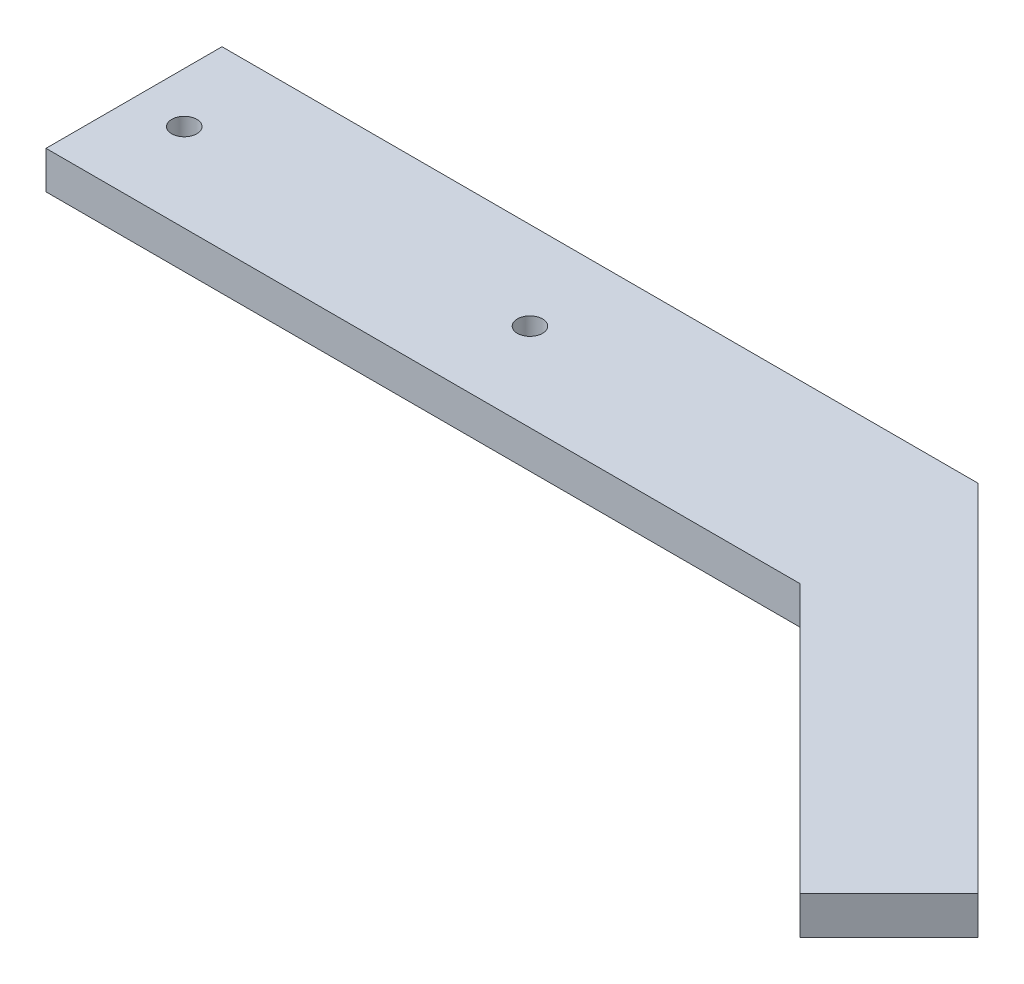
ISO-10303-21;
HEADER;
FILE_DESCRIPTION(('STEP AP214'),'2;1');
FILE_NAME('part.step','',(''),(''),'','','');
FILE_SCHEMA(('AUTOMOTIVE_DESIGN { 1 0 10303 214 1 1 1 1 }'));
ENDSEC;
DATA;
#1=APPLICATION_CONTEXT('core data for automotive mechanical design processes');
#2=APPLICATION_PROTOCOL_DEFINITION('international standard','automotive_design',2000,#1);
#3=PRODUCT_CONTEXT('',#1,'mechanical');
#4=PRODUCT('Part','Part','',(#3));
#5=PRODUCT_RELATED_PRODUCT_CATEGORY('part','',(#4));
#6=PRODUCT_DEFINITION_FORMATION('','',#4);
#7=PRODUCT_DEFINITION_CONTEXT('part definition',#1,'design');
#8=PRODUCT_DEFINITION('design','',#6,#7);
#9=PRODUCT_DEFINITION_SHAPE('','',#8);
#10=(LENGTH_UNIT() NAMED_UNIT(*) SI_UNIT(.MILLI.,.METRE.));
#11=(NAMED_UNIT(*) PLANE_ANGLE_UNIT() SI_UNIT($,.RADIAN.));
#12=(NAMED_UNIT(*) SI_UNIT($,.STERADIAN.) SOLID_ANGLE_UNIT());
#13=UNCERTAINTY_MEASURE_WITH_UNIT(LENGTH_MEASURE(1.E-05),#10,'distance_accuracy_value','');
#14=(GEOMETRIC_REPRESENTATION_CONTEXT(3) GLOBAL_UNCERTAINTY_ASSIGNED_CONTEXT((#13)) GLOBAL_UNIT_ASSIGNED_CONTEXT((#10,
#11,#12)) REPRESENTATION_CONTEXT('',''));
#15=CARTESIAN_POINT('',(0.,0.,0.));
#16=DIRECTION('',(0.,0.,1.));
#17=DIRECTION('',(1.,0.,0.));
#18=AXIS2_PLACEMENT_3D('',#15,#16,#17);
#19=CARTESIAN_POINT('',(0.,3.,0.));
#20=DIRECTION('',(1.,0.,0.));
#21=DIRECTION('',(0.,0.,-1.));
#22=AXIS2_PLACEMENT_3D('',#19,#20,#21);
#23=PLANE('',#22);
#24=DIRECTION('',(0.,0.,1.));
#25=VECTOR('',#24,1.);
#26=CARTESIAN_POINT('',(0.,0.,0.));
#27=LINE('',#26,#25);
#28=CARTESIAN_POINT('',(0.,0.,-14.));
#29=VERTEX_POINT('',#28);
#30=CARTESIAN_POINT('',(0.,0.,0.));
#31=VERTEX_POINT('',#30);
#32=EDGE_CURVE('E117',#29,#31,#27,.T.);
#33=ORIENTED_EDGE('',*,*,#32,.T.);
#34=DIRECTION('',(0.,-1.,0.));
#35=VECTOR('',#34,1.);
#36=CARTESIAN_POINT('',(0.,3.,0.));
#37=LINE('',#36,#35);
#38=CARTESIAN_POINT('',(0.,3.,0.));
#39=VERTEX_POINT('',#38);
#40=EDGE_CURVE('E11',#39,#31,#37,.T.);
#41=ORIENTED_EDGE('',*,*,#40,.F.);
#42=DIRECTION('',(0.,0.,1.));
#43=VECTOR('',#42,1.);
#44=CARTESIAN_POINT('',(0.,3.,0.));
#45=LINE('',#44,#43);
#46=CARTESIAN_POINT('',(0.,3.,-14.));
#47=VERTEX_POINT('',#46);
#48=EDGE_CURVE('E128',#47,#39,#45,.T.);
#49=ORIENTED_EDGE('',*,*,#48,.F.);
#50=DIRECTION('',(0.,-1.,0.));
#51=VECTOR('',#50,1.);
#52=CARTESIAN_POINT('',(0.,3.,-14.));
#53=LINE('',#52,#51);
#54=EDGE_CURVE('E113',#47,#29,#53,.T.);
#55=ORIENTED_EDGE('',*,*,#54,.T.);
#56=EDGE_LOOP('',(#33,#41,#49,#55));
#57=FACE_BOUND('',#56,.T.);
#58=ADVANCED_FACE('F33',(#57),#23,.F.);
#59=CARTESIAN_POINT('',(0.,3.,0.));
#60=DIRECTION('',(0.,0.,-1.));
#61=DIRECTION('',(-1.,0.,0.));
#62=AXIS2_PLACEMENT_3D('',#59,#60,#61);
#63=PLANE('',#62);
#64=DIRECTION('',(1.,0.,0.));
#65=VECTOR('',#64,1.);
#66=CARTESIAN_POINT('',(0.,0.,0.));
#67=LINE('',#66,#65);
#68=CARTESIAN_POINT('',(60.,0.,0.));
#69=VERTEX_POINT('',#68);
#70=EDGE_CURVE('E120',#31,#69,#67,.T.);
#71=ORIENTED_EDGE('',*,*,#70,.T.);
#72=DIRECTION('',(0.,-1.,0.));
#73=VECTOR('',#72,1.);
#74=CARTESIAN_POINT('',(60.,3.,0.));
#75=LINE('',#74,#73);
#76=CARTESIAN_POINT('',(60.,3.,0.));
#77=VERTEX_POINT('',#76);
#78=EDGE_CURVE('E41',#77,#69,#75,.T.);
#79=ORIENTED_EDGE('',*,*,#78,.F.);
#80=DIRECTION('',(1.,0.,0.));
#81=VECTOR('',#80,1.);
#82=CARTESIAN_POINT('',(0.,3.,0.));
#83=LINE('',#82,#81);
#84=EDGE_CURVE('E86',#39,#77,#83,.T.);
#85=ORIENTED_EDGE('',*,*,#84,.F.);
#86=ORIENTED_EDGE('',*,*,#40,.T.);
#87=EDGE_LOOP('',(#71,#79,#85,#86));
#88=FACE_BOUND('',#87,.T.);
#89=ADVANCED_FACE('F153',(#88),#63,.F.);
#90=CARTESIAN_POINT('',(81.3553390593275,3.,21.3553390593273));
#91=DIRECTION('',(0.707106781186543,0.,-0.707106781186552));
#92=DIRECTION('',(-0.707106781186552,0.,-0.707106781186543));
#93=AXIS2_PLACEMENT_3D('',#90,#91,#92);
#94=PLANE('',#93);
#95=DIRECTION('',(0.707106781186552,0.,0.707106781186543));
#96=VECTOR('',#95,1.);
#97=CARTESIAN_POINT('',(81.3553390593275,0.,21.3553390593273));
#98=LINE('',#97,#96);
#99=CARTESIAN_POINT('',(81.3553390593275,0.,21.3553390593273));
#100=VERTEX_POINT('',#99);
#101=EDGE_CURVE('E123',#69,#100,#98,.T.);
#102=ORIENTED_EDGE('',*,*,#101,.T.);
#103=DIRECTION('',(0.,-1.,0.));
#104=VECTOR('',#103,1.);
#105=CARTESIAN_POINT('',(81.3553390593275,3.,21.3553390593273));
#106=LINE('',#105,#104);
#107=CARTESIAN_POINT('',(81.3553390593275,3.,21.3553390593273));
#108=VERTEX_POINT('',#107);
#109=EDGE_CURVE('E108',#108,#100,#106,.T.);
#110=ORIENTED_EDGE('',*,*,#109,.F.);
#111=DIRECTION('',(0.707106781186552,0.,0.707106781186543));
#112=VECTOR('',#111,1.);
#113=CARTESIAN_POINT('',(81.3553390593275,3.,21.3553390593273));
#114=LINE('',#113,#112);
#115=EDGE_CURVE('E99',#77,#108,#114,.T.);
#116=ORIENTED_EDGE('',*,*,#115,.F.);
#117=ORIENTED_EDGE('',*,*,#78,.T.);
#118=EDGE_LOOP('',(#102,#110,#116,#117));
#119=FACE_BOUND('',#118,.T.);
#120=ADVANCED_FACE('F134',(#119),#94,.F.);
#121=CARTESIAN_POINT('',(81.3553390593275,3.,21.3553390593273));
#122=DIRECTION('',(-0.707106781186554,0.,-0.707106781186541));
#123=DIRECTION('',(-0.707106781186541,0.,0.707106781186554));
#124=AXIS2_PLACEMENT_3D('',#121,#122,#123);
#125=PLANE('',#124);
#126=DIRECTION('',(0.707106781186541,0.,-0.707106781186554));
#127=VECTOR('',#126,1.);
#128=CARTESIAN_POINT('',(81.3553390593275,0.,21.3553390593273));
#129=LINE('',#128,#127);
#130=CARTESIAN_POINT('',(88.426406871193,0.,14.2842712474617));
#131=VERTEX_POINT('',#130);
#132=EDGE_CURVE('E107',#100,#131,#129,.T.);
#133=ORIENTED_EDGE('',*,*,#132,.T.);
#134=DIRECTION('',(0.,-1.,0.));
#135=VECTOR('',#134,1.);
#136=CARTESIAN_POINT('',(88.426406871193,3.,14.2842712474617));
#137=LINE('',#136,#135);
#138=CARTESIAN_POINT('',(88.426406871193,3.,14.2842712474617));
#139=VERTEX_POINT('',#138);
#140=EDGE_CURVE('E104',#139,#131,#137,.T.);
#141=ORIENTED_EDGE('',*,*,#140,.F.);
#142=DIRECTION('',(0.707106781186541,0.,-0.707106781186554));
#143=VECTOR('',#142,1.);
#144=CARTESIAN_POINT('',(81.3553390593275,3.,21.3553390593273));
#145=LINE('',#144,#143);
#146=EDGE_CURVE('E93',#108,#139,#145,.T.);
#147=ORIENTED_EDGE('',*,*,#146,.F.);
#148=ORIENTED_EDGE('',*,*,#109,.T.);
#149=EDGE_LOOP('',(#133,#141,#147,#148));
#150=FACE_BOUND('',#149,.T.);
#151=ADVANCED_FACE('F105',(#150),#125,.F.);
#152=CARTESIAN_POINT('',(60.1421356237309,3.,-14.));
#153=DIRECTION('',(-0.707106781186543,0.,0.707106781186552));
#154=DIRECTION('',(0.707106781186552,0.,0.707106781186543));
#155=AXIS2_PLACEMENT_3D('',#152,#153,#154);
#156=PLANE('',#155);
#157=DIRECTION('',(-0.707106781186552,0.,-0.707106781186543));
#158=VECTOR('',#157,1.);
#159=CARTESIAN_POINT('',(60.1421356237309,0.,-14.));
#160=LINE('',#159,#158);
#161=CARTESIAN_POINT('',(60.1421356237309,0.,-14.));
#162=VERTEX_POINT('',#161);
#163=EDGE_CURVE('E72',#131,#162,#160,.T.);
#164=ORIENTED_EDGE('',*,*,#163,.T.);
#165=DIRECTION('',(0.,-1.,0.));
#166=VECTOR('',#165,1.);
#167=CARTESIAN_POINT('',(60.1421356237309,3.,-14.));
#168=LINE('',#167,#166);
#169=CARTESIAN_POINT('',(60.1421356237309,3.,-14.));
#170=VERTEX_POINT('',#169);
#171=EDGE_CURVE('E109',#170,#162,#168,.T.);
#172=ORIENTED_EDGE('',*,*,#171,.F.);
#173=DIRECTION('',(-0.707106781186552,0.,-0.707106781186543));
#174=VECTOR('',#173,1.);
#175=CARTESIAN_POINT('',(60.1421356237309,3.,-14.));
#176=LINE('',#175,#174);
#177=EDGE_CURVE('E97',#139,#170,#176,.T.);
#178=ORIENTED_EDGE('',*,*,#177,.F.);
#179=ORIENTED_EDGE('',*,*,#140,.T.);
#180=EDGE_LOOP('',(#164,#172,#178,#179));
#181=FACE_BOUND('',#180,.T.);
#182=ADVANCED_FACE('F111',(#181),#156,.F.);
#183=CARTESIAN_POINT('',(0.,3.,-14.));
#184=DIRECTION('',(0.,0.,1.));
#185=DIRECTION('',(1.,0.,0.));
#186=AXIS2_PLACEMENT_3D('',#183,#184,#185);
#187=PLANE('',#186);
#188=DIRECTION('',(-1.,0.,0.));
#189=VECTOR('',#188,1.);
#190=CARTESIAN_POINT('',(0.,0.,-14.));
#191=LINE('',#190,#189);
#192=EDGE_CURVE('E78',#162,#29,#191,.T.);
#193=ORIENTED_EDGE('',*,*,#192,.T.);
#194=ORIENTED_EDGE('',*,*,#54,.F.);
#195=DIRECTION('',(-1.,0.,0.));
#196=VECTOR('',#195,1.);
#197=CARTESIAN_POINT('',(0.,3.,-14.));
#198=LINE('',#197,#196);
#199=EDGE_CURVE('E49',#170,#47,#198,.T.);
#200=ORIENTED_EDGE('',*,*,#199,.F.);
#201=ORIENTED_EDGE('',*,*,#171,.T.);
#202=EDGE_LOOP('',(#193,#194,#200,#201));
#203=FACE_BOUND('',#202,.T.);
#204=ADVANCED_FACE('F141',(#203),#187,.F.);
#205=CARTESIAN_POINT('',(0.,3.,0.));
#206=DIRECTION('',(0.,-1.,0.));
#207=DIRECTION('',(0.,0.,-1.));
#208=AXIS2_PLACEMENT_3D('',#205,#206,#207);
#209=PLANE('',#208);
#210=CARTESIAN_POINT('',(31.5,3.,-7.));
#211=DIRECTION('',(0.,1.,0.));
#212=DIRECTION('',(0.,0.,1.));
#213=AXIS2_PLACEMENT_3D('',#210,#211,#212);
#214=CIRCLE('',#213,0.999999999999998);
#215=CARTESIAN_POINT('',(31.5,3.,-6.));
#216=VERTEX_POINT('',#215);
#217=EDGE_CURVE('E216',#216,#216,#214,.T.);
#218=ORIENTED_EDGE('',*,*,#217,.F.);
#219=EDGE_LOOP('',(#218));
#220=FACE_BOUND('',#219,.T.);
#221=CARTESIAN_POINT('',(4.,3.,-7.));
#222=DIRECTION('',(0.,1.,0.));
#223=DIRECTION('',(0.,0.,1.));
#224=AXIS2_PLACEMENT_3D('',#221,#222,#223);
#225=CIRCLE('',#224,1.);
#226=CARTESIAN_POINT('',(4.,3.,-6.));
#227=VERTEX_POINT('',#226);
#228=EDGE_CURVE('E220',#227,#227,#225,.T.);
#229=ORIENTED_EDGE('',*,*,#228,.F.);
#230=EDGE_LOOP('',(#229));
#231=FACE_BOUND('',#230,.T.);
#232=ORIENTED_EDGE('',*,*,#48,.T.);
#233=ORIENTED_EDGE('',*,*,#84,.T.);
#234=ORIENTED_EDGE('',*,*,#115,.T.);
#235=ORIENTED_EDGE('',*,*,#146,.T.);
#236=ORIENTED_EDGE('',*,*,#177,.T.);
#237=ORIENTED_EDGE('',*,*,#199,.T.);
#238=EDGE_LOOP('',(#232,#233,#234,#235,#236,#237));
#239=FACE_BOUND('',#238,.T.);
#240=ADVANCED_FACE('F95',(#220,#231,#239),#209,.F.);
#241=CARTESIAN_POINT('',(0.,0.,0.));
#242=DIRECTION('',(0.,-1.,0.));
#243=DIRECTION('',(0.,0.,-1.));
#244=AXIS2_PLACEMENT_3D('',#241,#242,#243);
#245=PLANE('',#244);
#246=CARTESIAN_POINT('',(31.5,0.,-7.));
#247=DIRECTION('',(0.,-1.,0.));
#248=DIRECTION('',(0.,0.,-1.));
#249=AXIS2_PLACEMENT_3D('',#246,#247,#248);
#250=CIRCLE('',#249,0.999999999999998);
#251=CARTESIAN_POINT('',(31.5,0.,-8.));
#252=VERTEX_POINT('',#251);
#253=EDGE_CURVE('E219',#252,#252,#250,.F.);
#254=ORIENTED_EDGE('',*,*,#253,.T.);
#255=EDGE_LOOP('',(#254));
#256=FACE_BOUND('',#255,.T.);
#257=CARTESIAN_POINT('',(4.,0.,-7.));
#258=DIRECTION('',(0.,-1.,0.));
#259=DIRECTION('',(0.,0.,-1.));
#260=AXIS2_PLACEMENT_3D('',#257,#258,#259);
#261=CIRCLE('',#260,1.);
#262=CARTESIAN_POINT('',(4.,0.,-8.));
#263=VERTEX_POINT('',#262);
#264=EDGE_CURVE('E121',#263,#263,#261,.F.);
#265=ORIENTED_EDGE('',*,*,#264,.T.);
#266=EDGE_LOOP('',(#265));
#267=FACE_BOUND('',#266,.T.);
#268=ORIENTED_EDGE('',*,*,#32,.F.);
#269=ORIENTED_EDGE('',*,*,#192,.F.);
#270=ORIENTED_EDGE('',*,*,#163,.F.);
#271=ORIENTED_EDGE('',*,*,#132,.F.);
#272=ORIENTED_EDGE('',*,*,#101,.F.);
#273=ORIENTED_EDGE('',*,*,#70,.F.);
#274=EDGE_LOOP('',(#268,#269,#270,#271,#272,#273));
#275=FACE_BOUND('',#274,.T.);
#276=ADVANCED_FACE('F137',(#256,#267,#275),#245,.T.);
#277=CARTESIAN_POINT('',(4.,-2.82842712474619,-7.));
#278=DIRECTION('',(0.,1.,0.));
#279=DIRECTION('',(0.,0.,1.));
#280=AXIS2_PLACEMENT_3D('',#277,#278,#279);
#281=CYLINDRICAL_SURFACE('',#280,1.);
#282=ORIENTED_EDGE('',*,*,#228,.T.);
#283=EDGE_LOOP('',(#282));
#284=FACE_BOUND('',#283,.T.);
#285=ORIENTED_EDGE('',*,*,#264,.F.);
#286=EDGE_LOOP('',(#285));
#287=FACE_BOUND('',#286,.T.);
#288=ADVANCED_FACE('F190',(#284,#287),#281,.F.);
#289=CARTESIAN_POINT('',(31.5,-2.82842712474619,-7.));
#290=DIRECTION('',(0.,1.,0.));
#291=DIRECTION('',(0.,0.,1.));
#292=AXIS2_PLACEMENT_3D('',#289,#290,#291);
#293=CYLINDRICAL_SURFACE('',#292,0.999999999999998);
#294=ORIENTED_EDGE('',*,*,#217,.T.);
#295=EDGE_LOOP('',(#294));
#296=FACE_BOUND('',#295,.T.);
#297=ORIENTED_EDGE('',*,*,#253,.F.);
#298=EDGE_LOOP('',(#297));
#299=FACE_BOUND('',#298,.T.);
#300=ADVANCED_FACE('F199',(#296,#299),#293,.F.);
#301=CLOSED_SHELL('',(#58,#89,#120,#151,#182,#204,#240,#276,#288,#300));
#302=MANIFOLD_SOLID_BREP('B2',#301);
#303=ADVANCED_BREP_SHAPE_REPRESENTATION('',(#18,#302),#14);
#304=SHAPE_DEFINITION_REPRESENTATION(#9,#303);
ENDSEC;
END-ISO-10303-21;
